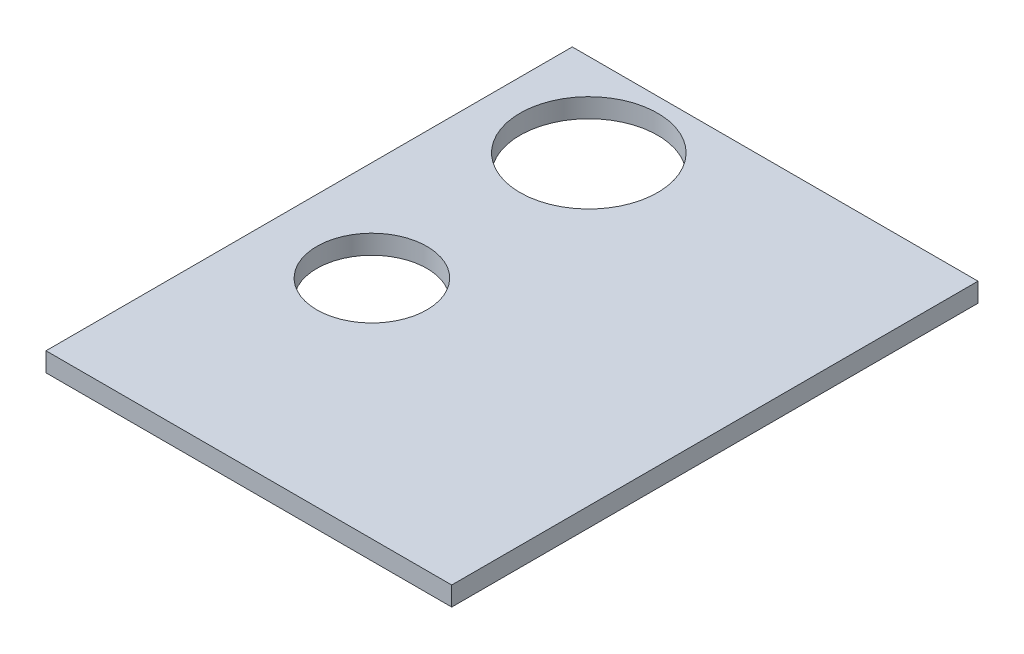
ISO-10303-21;
HEADER;
FILE_DESCRIPTION(('STEP AP214'),'2;1');
FILE_NAME('part.step','',(''),(''),'','','');
FILE_SCHEMA(('AUTOMOTIVE_DESIGN { 1 0 10303 214 1 1 1 1 }'));
ENDSEC;
DATA;
#1=APPLICATION_CONTEXT('core data for automotive mechanical design processes');
#2=APPLICATION_PROTOCOL_DEFINITION('international standard','automotive_design',2000,#1);
#3=PRODUCT_CONTEXT('',#1,'mechanical');
#4=PRODUCT('Part','Part','',(#3));
#5=PRODUCT_RELATED_PRODUCT_CATEGORY('part','',(#4));
#6=PRODUCT_DEFINITION_FORMATION('','',#4);
#7=PRODUCT_DEFINITION_CONTEXT('part definition',#1,'design');
#8=PRODUCT_DEFINITION('design','',#6,#7);
#9=PRODUCT_DEFINITION_SHAPE('','',#8);
#10=(LENGTH_UNIT() NAMED_UNIT(*) SI_UNIT(.MILLI.,.METRE.));
#11=(NAMED_UNIT(*) PLANE_ANGLE_UNIT() SI_UNIT($,.RADIAN.));
#12=(NAMED_UNIT(*) SI_UNIT($,.STERADIAN.) SOLID_ANGLE_UNIT());
#13=UNCERTAINTY_MEASURE_WITH_UNIT(LENGTH_MEASURE(1.E-05),#10,'distance_accuracy_value','');
#14=(GEOMETRIC_REPRESENTATION_CONTEXT(3) GLOBAL_UNCERTAINTY_ASSIGNED_CONTEXT((#13)) GLOBAL_UNIT_ASSIGNED_CONTEXT((#10,
#11,#12)) REPRESENTATION_CONTEXT('',''));
#15=CARTESIAN_POINT('',(0.,0.,0.));
#16=DIRECTION('',(0.,0.,1.));
#17=DIRECTION('',(1.,0.,0.));
#18=AXIS2_PLACEMENT_3D('',#15,#16,#17);
#19=CARTESIAN_POINT('',(0.,4.,0.));
#20=DIRECTION('',(1.,0.,0.));
#21=DIRECTION('',(0.,0.,-1.));
#22=AXIS2_PLACEMENT_3D('',#19,#20,#21);
#23=PLANE('',#22);
#24=DIRECTION('',(0.,0.,1.));
#25=VECTOR('',#24,1.);
#26=CARTESIAN_POINT('',(0.,0.,0.));
#27=LINE('',#26,#25);
#28=CARTESIAN_POINT('',(0.,0.,0.));
#29=VERTEX_POINT('',#28);
#30=CARTESIAN_POINT('',(0.,0.,110.));
#31=VERTEX_POINT('',#30);
#32=EDGE_CURVE('E101',#29,#31,#27,.T.);
#33=ORIENTED_EDGE('',*,*,#32,.T.);
#34=DIRECTION('',(0.,-1.,0.));
#35=VECTOR('',#34,1.);
#36=CARTESIAN_POINT('',(0.,4.,110.));
#37=LINE('',#36,#35);
#38=CARTESIAN_POINT('',(0.,4.,110.));
#39=VERTEX_POINT('',#38);
#40=EDGE_CURVE('E11',#39,#31,#37,.T.);
#41=ORIENTED_EDGE('',*,*,#40,.F.);
#42=DIRECTION('',(0.,0.,1.));
#43=VECTOR('',#42,1.);
#44=CARTESIAN_POINT('',(0.,4.,0.));
#45=LINE('',#44,#43);
#46=CARTESIAN_POINT('',(0.,4.,0.));
#47=VERTEX_POINT('',#46);
#48=EDGE_CURVE('E89',#47,#39,#45,.T.);
#49=ORIENTED_EDGE('',*,*,#48,.F.);
#50=DIRECTION('',(0.,-1.,0.));
#51=VECTOR('',#50,1.);
#52=CARTESIAN_POINT('',(0.,4.,0.));
#53=LINE('',#52,#51);
#54=EDGE_CURVE('E97',#47,#29,#53,.T.);
#55=ORIENTED_EDGE('',*,*,#54,.T.);
#56=EDGE_LOOP('',(#33,#41,#49,#55));
#57=FACE_BOUND('',#56,.T.);
#58=ADVANCED_FACE('F38',(#57),#23,.F.);
#59=CARTESIAN_POINT('',(0.,4.,110.));
#60=DIRECTION('',(0.,0.,-1.));
#61=DIRECTION('',(-1.,0.,0.));
#62=AXIS2_PLACEMENT_3D('',#59,#60,#61);
#63=PLANE('',#62);
#64=DIRECTION('',(1.,0.,0.));
#65=VECTOR('',#64,1.);
#66=CARTESIAN_POINT('',(0.,0.,110.));
#67=LINE('',#66,#65);
#68=CARTESIAN_POINT('',(84.8031893051056,0.,110.));
#69=VERTEX_POINT('',#68);
#70=EDGE_CURVE('E93',#31,#69,#67,.T.);
#71=ORIENTED_EDGE('',*,*,#70,.T.);
#72=DIRECTION('',(0.,-1.,0.));
#73=VECTOR('',#72,1.);
#74=CARTESIAN_POINT('',(84.8031893051056,4.,110.));
#75=LINE('',#74,#73);
#76=CARTESIAN_POINT('',(84.8031893051056,4.,110.));
#77=VERTEX_POINT('',#76);
#78=EDGE_CURVE('E46',#77,#69,#75,.T.);
#79=ORIENTED_EDGE('',*,*,#78,.F.);
#80=DIRECTION('',(1.,0.,0.));
#81=VECTOR('',#80,1.);
#82=CARTESIAN_POINT('',(0.,4.,110.));
#83=LINE('',#82,#81);
#84=EDGE_CURVE('E84',#39,#77,#83,.T.);
#85=ORIENTED_EDGE('',*,*,#84,.F.);
#86=ORIENTED_EDGE('',*,*,#40,.T.);
#87=EDGE_LOOP('',(#71,#79,#85,#86));
#88=FACE_BOUND('',#87,.T.);
#89=ADVANCED_FACE('F92',(#88),#63,.F.);
#90=CARTESIAN_POINT('',(84.8031893051056,4.,0.));
#91=DIRECTION('',(-1.,0.,0.));
#92=DIRECTION('',(0.,0.,1.));
#93=AXIS2_PLACEMENT_3D('',#90,#91,#92);
#94=PLANE('',#93);
#95=DIRECTION('',(0.,0.,-1.));
#96=VECTOR('',#95,1.);
#97=CARTESIAN_POINT('',(84.8031893051056,0.,0.));
#98=LINE('',#97,#96);
#99=CARTESIAN_POINT('',(84.8031893051056,0.,0.));
#100=VERTEX_POINT('',#99);
#101=EDGE_CURVE('E71',#69,#100,#98,.T.);
#102=ORIENTED_EDGE('',*,*,#101,.T.);
#103=DIRECTION('',(0.,-1.,0.));
#104=VECTOR('',#103,1.);
#105=CARTESIAN_POINT('',(84.8031893051056,4.,0.));
#106=LINE('',#105,#104);
#107=CARTESIAN_POINT('',(84.8031893051056,4.,0.));
#108=VERTEX_POINT('',#107);
#109=EDGE_CURVE('E94',#108,#100,#106,.T.);
#110=ORIENTED_EDGE('',*,*,#109,.F.);
#111=DIRECTION('',(0.,0.,-1.));
#112=VECTOR('',#111,1.);
#113=CARTESIAN_POINT('',(84.8031893051056,4.,0.));
#114=LINE('',#113,#112);
#115=EDGE_CURVE('E87',#77,#108,#114,.T.);
#116=ORIENTED_EDGE('',*,*,#115,.F.);
#117=ORIENTED_EDGE('',*,*,#78,.T.);
#118=EDGE_LOOP('',(#102,#110,#116,#117));
#119=FACE_BOUND('',#118,.T.);
#120=ADVANCED_FACE('F95',(#119),#94,.F.);
#121=CARTESIAN_POINT('',(0.,4.,0.));
#122=DIRECTION('',(0.,0.,1.));
#123=DIRECTION('',(1.,0.,0.));
#124=AXIS2_PLACEMENT_3D('',#121,#122,#123);
#125=PLANE('',#124);
#126=DIRECTION('',(-1.,0.,0.));
#127=VECTOR('',#126,1.);
#128=CARTESIAN_POINT('',(0.,0.,0.));
#129=LINE('',#128,#127);
#130=EDGE_CURVE('E77',#100,#29,#129,.T.);
#131=ORIENTED_EDGE('',*,*,#130,.T.);
#132=ORIENTED_EDGE('',*,*,#54,.F.);
#133=DIRECTION('',(-1.,0.,0.));
#134=VECTOR('',#133,1.);
#135=CARTESIAN_POINT('',(0.,4.,0.));
#136=LINE('',#135,#134);
#137=EDGE_CURVE('E54',#108,#47,#136,.T.);
#138=ORIENTED_EDGE('',*,*,#137,.F.);
#139=ORIENTED_EDGE('',*,*,#109,.T.);
#140=EDGE_LOOP('',(#131,#132,#138,#139));
#141=FACE_BOUND('',#140,.T.);
#142=ADVANCED_FACE('F109',(#141),#125,.F.);
#143=CARTESIAN_POINT('',(0.,4.,0.));
#144=DIRECTION('',(0.,1.,0.));
#145=DIRECTION('',(0.,0.,1.));
#146=AXIS2_PLACEMENT_3D('',#143,#144,#145);
#147=PLANE('',#146);
#148=CARTESIAN_POINT('',(20.9046860248484,4.,17.4483364386478));
#149=DIRECTION('',(0.,1.,0.));
#150=DIRECTION('',(0.,0.,1.));
#151=AXIS2_PLACEMENT_3D('',#148,#149,#150);
#152=CIRCLE('',#151,14.383210577879);
#153=CARTESIAN_POINT('',(20.9046860248484,4.,31.8315470165269));
#154=VERTEX_POINT('',#153);
#155=EDGE_CURVE('E121',#154,#154,#152,.T.);
#156=ORIENTED_EDGE('',*,*,#155,.F.);
#157=EDGE_LOOP('',(#156));
#158=FACE_BOUND('',#157,.T.);
#159=CARTESIAN_POINT('',(20.9046860248484,4.,62.7908148528039));
#160=DIRECTION('',(0.,1.,0.));
#161=DIRECTION('',(0.,0.,1.));
#162=AXIS2_PLACEMENT_3D('',#159,#160,#161);
#163=CIRCLE('',#162,11.5);
#164=CARTESIAN_POINT('',(20.9046860248484,4.,74.2908148528039));
#165=VERTEX_POINT('',#164);
#166=EDGE_CURVE('E118',#165,#165,#163,.T.);
#167=ORIENTED_EDGE('',*,*,#166,.F.);
#168=EDGE_LOOP('',(#167));
#169=FACE_BOUND('',#168,.T.);
#170=ORIENTED_EDGE('',*,*,#48,.T.);
#171=ORIENTED_EDGE('',*,*,#84,.T.);
#172=ORIENTED_EDGE('',*,*,#115,.T.);
#173=ORIENTED_EDGE('',*,*,#137,.T.);
#174=EDGE_LOOP('',(#170,#171,#172,#173));
#175=FACE_BOUND('',#174,.T.);
#176=ADVANCED_FACE('F85',(#158,#169,#175),#147,.T.);
#177=CARTESIAN_POINT('',(0.,0.,0.));
#178=DIRECTION('',(0.,1.,0.));
#179=DIRECTION('',(0.,0.,1.));
#180=AXIS2_PLACEMENT_3D('',#177,#178,#179);
#181=PLANE('',#180);
#182=CARTESIAN_POINT('',(20.9046860248484,0.,17.4483364386478));
#183=DIRECTION('',(0.,1.,0.));
#184=DIRECTION('',(0.,0.,1.));
#185=AXIS2_PLACEMENT_3D('',#182,#183,#184);
#186=CIRCLE('',#185,14.383210577879);
#187=CARTESIAN_POINT('',(20.9046860248484,0.,31.8315470165269));
#188=VERTEX_POINT('',#187);
#189=EDGE_CURVE('E104',#188,#188,#186,.T.);
#190=ORIENTED_EDGE('',*,*,#189,.T.);
#191=EDGE_LOOP('',(#190));
#192=FACE_BOUND('',#191,.T.);
#193=CARTESIAN_POINT('',(20.9046860248484,0.,62.7908148528039));
#194=DIRECTION('',(0.,1.,0.));
#195=DIRECTION('',(0.,0.,1.));
#196=AXIS2_PLACEMENT_3D('',#193,#194,#195);
#197=CIRCLE('',#196,11.5);
#198=CARTESIAN_POINT('',(20.9046860248484,0.,74.2908148528039));
#199=VERTEX_POINT('',#198);
#200=EDGE_CURVE('E115',#199,#199,#197,.T.);
#201=ORIENTED_EDGE('',*,*,#200,.T.);
#202=EDGE_LOOP('',(#201));
#203=FACE_BOUND('',#202,.T.);
#204=ORIENTED_EDGE('',*,*,#32,.F.);
#205=ORIENTED_EDGE('',*,*,#130,.F.);
#206=ORIENTED_EDGE('',*,*,#101,.F.);
#207=ORIENTED_EDGE('',*,*,#70,.F.);
#208=EDGE_LOOP('',(#204,#205,#206,#207));
#209=FACE_BOUND('',#208,.T.);
#210=ADVANCED_FACE('F112',(#192,#203,#209),#181,.F.);
#211=CARTESIAN_POINT('',(20.9046860248484,0.,62.7908148528039));
#212=DIRECTION('',(0.,1.,0.));
#213=DIRECTION('',(0.,0.,1.));
#214=AXIS2_PLACEMENT_3D('',#211,#212,#213);
#215=CYLINDRICAL_SURFACE('',#214,11.5);
#216=ORIENTED_EDGE('',*,*,#200,.F.);
#217=EDGE_LOOP('',(#216));
#218=FACE_BOUND('',#217,.T.);
#219=ORIENTED_EDGE('',*,*,#166,.T.);
#220=EDGE_LOOP('',(#219));
#221=FACE_BOUND('',#220,.T.);
#222=ADVANCED_FACE('F132',(#218,#221),#215,.F.);
#223=CARTESIAN_POINT('',(20.9046860248484,0.,17.4483364386478));
#224=DIRECTION('',(0.,1.,0.));
#225=DIRECTION('',(0.,0.,1.));
#226=AXIS2_PLACEMENT_3D('',#223,#224,#225);
#227=CYLINDRICAL_SURFACE('',#226,14.383210577879);
#228=ORIENTED_EDGE('',*,*,#189,.F.);
#229=EDGE_LOOP('',(#228));
#230=FACE_BOUND('',#229,.T.);
#231=ORIENTED_EDGE('',*,*,#155,.T.);
#232=EDGE_LOOP('',(#231));
#233=FACE_BOUND('',#232,.T.);
#234=ADVANCED_FACE('F129',(#230,#233),#227,.F.);
#235=CLOSED_SHELL('',(#58,#89,#120,#142,#176,#210,#222,#234));
#236=MANIFOLD_SOLID_BREP('B2',#235);
#237=ADVANCED_BREP_SHAPE_REPRESENTATION('',(#18,#236),#14);
#238=SHAPE_DEFINITION_REPRESENTATION(#9,#237);
ENDSEC;
END-ISO-10303-21;
